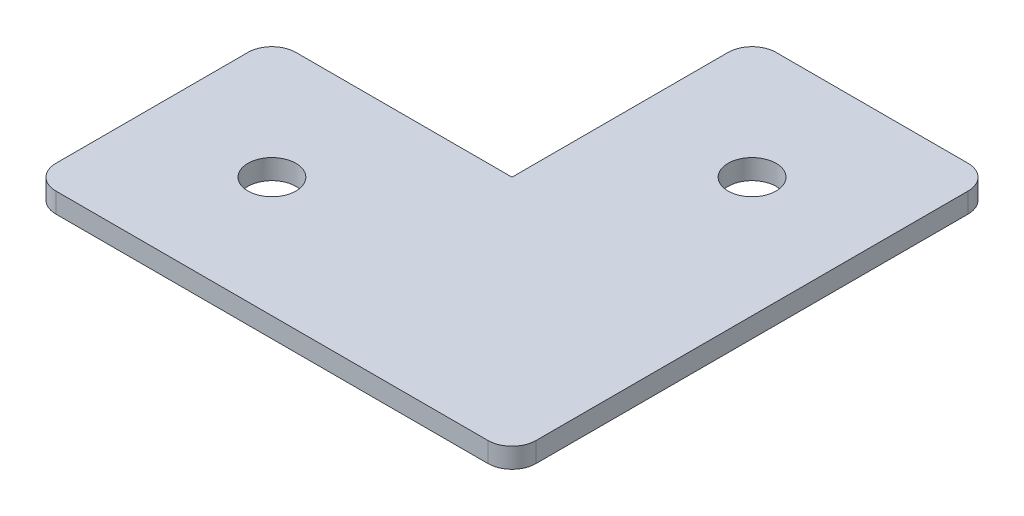
ISO-10303-21;
HEADER;
FILE_DESCRIPTION(('STEP AP214'),'2;1');
FILE_NAME('part.step','',(''),(''),'','','');
FILE_SCHEMA(('AUTOMOTIVE_DESIGN { 1 0 10303 214 1 1 1 1 }'));
ENDSEC;
DATA;
#1=APPLICATION_CONTEXT('core data for automotive mechanical design processes');
#2=APPLICATION_PROTOCOL_DEFINITION('international standard','automotive_design',2000,#1);
#3=PRODUCT_CONTEXT('',#1,'mechanical');
#4=PRODUCT('Part','Part','',(#3));
#5=PRODUCT_RELATED_PRODUCT_CATEGORY('part','',(#4));
#6=PRODUCT_DEFINITION_FORMATION('','',#4);
#7=PRODUCT_DEFINITION_CONTEXT('part definition',#1,'design');
#8=PRODUCT_DEFINITION('design','',#6,#7);
#9=PRODUCT_DEFINITION_SHAPE('','',#8);
#10=(LENGTH_UNIT() NAMED_UNIT(*) SI_UNIT(.MILLI.,.METRE.));
#11=(NAMED_UNIT(*) PLANE_ANGLE_UNIT() SI_UNIT($,.RADIAN.));
#12=(NAMED_UNIT(*) SI_UNIT($,.STERADIAN.) SOLID_ANGLE_UNIT());
#13=UNCERTAINTY_MEASURE_WITH_UNIT(LENGTH_MEASURE(1.E-05),#10,'distance_accuracy_value','');
#14=(GEOMETRIC_REPRESENTATION_CONTEXT(3) GLOBAL_UNCERTAINTY_ASSIGNED_CONTEXT((#13)) GLOBAL_UNIT_ASSIGNED_CONTEXT((#10,
#11,#12)) REPRESENTATION_CONTEXT('',''));
#15=CARTESIAN_POINT('',(0.,0.,0.));
#16=DIRECTION('',(0.,0.,1.));
#17=DIRECTION('',(1.,0.,0.));
#18=AXIS2_PLACEMENT_3D('',#15,#16,#17);
#19=CARTESIAN_POINT('',(-12.4698795180723,2.5,-24.8493975903614));
#20=DIRECTION('',(1.,0.,0.));
#21=DIRECTION('',(0.,0.,-1.));
#22=AXIS2_PLACEMENT_3D('',#19,#20,#21);
#23=PLANE('',#22);
#24=DIRECTION('',(0.,0.,1.));
#25=VECTOR('',#24,1.);
#26=CARTESIAN_POINT('',(-12.4698795180723,2.5,-24.8493975903614));
#27=LINE('',#26,#25);
#28=CARTESIAN_POINT('',(-12.4698795180723,2.5,-21.8493975903615));
#29=VERTEX_POINT('',#28);
#30=CARTESIAN_POINT('',(-12.4698795180723,2.5,5.15060240963856));
#31=VERTEX_POINT('',#30);
#32=EDGE_CURVE('E118',#29,#31,#27,.T.);
#33=ORIENTED_EDGE('',*,*,#32,.F.);
#34=DIRECTION('',(0.,-1.,0.));
#35=VECTOR('',#34,1.);
#36=CARTESIAN_POINT('',(-12.4698795180723,2.5,-21.8493975903615));
#37=LINE('',#36,#35);
#38=CARTESIAN_POINT('',(-12.4698795180723,0.,-21.8493975903615));
#39=VERTEX_POINT('',#38);
#40=EDGE_CURVE('E183',#29,#39,#37,.T.);
#41=ORIENTED_EDGE('',*,*,#40,.T.);
#42=DIRECTION('',(0.,0.,1.));
#43=VECTOR('',#42,1.);
#44=CARTESIAN_POINT('',(-12.4698795180723,0.,-24.8493975903614));
#45=LINE('',#44,#43);
#46=CARTESIAN_POINT('',(-12.4698795180723,0.,5.15060240963856));
#47=VERTEX_POINT('',#46);
#48=EDGE_CURVE('E139',#39,#47,#45,.T.);
#49=ORIENTED_EDGE('',*,*,#48,.T.);
#50=DIRECTION('',(0.,-1.,0.));
#51=VECTOR('',#50,1.);
#52=CARTESIAN_POINT('',(-12.4698795180723,2.5,5.15060240963856));
#53=LINE('',#52,#51);
#54=EDGE_CURVE('E134',#31,#47,#53,.T.);
#55=ORIENTED_EDGE('',*,*,#54,.F.);
#56=EDGE_LOOP('',(#33,#41,#49,#55));
#57=FACE_BOUND('',#56,.T.);
#58=ADVANCED_FACE('F33',(#57),#23,.F.);
#59=CARTESIAN_POINT('',(-12.4698795180723,2.5,5.15060240963856));
#60=DIRECTION('',(0.,0.,1.));
#61=DIRECTION('',(1.,0.,0.));
#62=AXIS2_PLACEMENT_3D('',#59,#60,#61);
#63=PLANE('',#62);
#64=DIRECTION('',(-1.,0.,0.));
#65=VECTOR('',#64,1.);
#66=CARTESIAN_POINT('',(-12.4698795180723,0.,5.15060240963856));
#67=LINE('',#66,#65);
#68=CARTESIAN_POINT('',(-39.4698795180723,0.,5.15060240963856));
#69=VERTEX_POINT('',#68);
#70=EDGE_CURVE('E208',#47,#69,#67,.T.);
#71=ORIENTED_EDGE('',*,*,#70,.T.);
#72=DIRECTION('',(0.,-1.,0.));
#73=VECTOR('',#72,1.);
#74=CARTESIAN_POINT('',(-39.4698795180723,2.5,5.15060240963856));
#75=LINE('',#74,#73);
#76=CARTESIAN_POINT('',(-39.4698795180723,2.5,5.15060240963856));
#77=VERTEX_POINT('',#76);
#78=EDGE_CURVE('E136',#69,#77,#75,.F.);
#79=ORIENTED_EDGE('',*,*,#78,.T.);
#80=DIRECTION('',(-1.,0.,0.));
#81=VECTOR('',#80,1.);
#82=CARTESIAN_POINT('',(-12.4698795180723,2.5,5.15060240963856));
#83=LINE('',#82,#81);
#84=EDGE_CURVE('E121',#31,#77,#83,.T.);
#85=ORIENTED_EDGE('',*,*,#84,.F.);
#86=ORIENTED_EDGE('',*,*,#54,.T.);
#87=EDGE_LOOP('',(#71,#79,#85,#86));
#88=FACE_BOUND('',#87,.T.);
#89=ADVANCED_FACE('F133',(#88),#63,.F.);
#90=CARTESIAN_POINT('',(-42.4698795180723,2.5,35.1506024096386));
#91=DIRECTION('',(1.,0.,0.));
#92=DIRECTION('',(0.,0.,-1.));
#93=AXIS2_PLACEMENT_3D('',#90,#91,#92);
#94=PLANE('',#93);
#95=DIRECTION('',(0.,0.,1.));
#96=VECTOR('',#95,1.);
#97=CARTESIAN_POINT('',(-42.4698795180723,0.,35.1506024096386));
#98=LINE('',#97,#96);
#99=CARTESIAN_POINT('',(-42.4698795180723,0.,8.15060240963856));
#100=VERTEX_POINT('',#99);
#101=CARTESIAN_POINT('',(-42.4698795180723,0.,32.1506024096385));
#102=VERTEX_POINT('',#101);
#103=EDGE_CURVE('E210',#100,#102,#98,.T.);
#104=ORIENTED_EDGE('',*,*,#103,.T.);
#105=DIRECTION('',(0.,-1.,0.));
#106=VECTOR('',#105,1.);
#107=CARTESIAN_POINT('',(-42.4698795180723,2.5,32.1506024096385));
#108=LINE('',#107,#106);
#109=CARTESIAN_POINT('',(-42.4698795180723,2.5,32.1506024096385));
#110=VERTEX_POINT('',#109);
#111=EDGE_CURVE('E161',#102,#110,#108,.F.);
#112=ORIENTED_EDGE('',*,*,#111,.T.);
#113=DIRECTION('',(0.,0.,1.));
#114=VECTOR('',#113,1.);
#115=CARTESIAN_POINT('',(-42.4698795180723,2.5,35.1506024096386));
#116=LINE('',#115,#114);
#117=CARTESIAN_POINT('',(-42.4698795180723,2.5,8.15060240963856));
#118=VERTEX_POINT('',#117);
#119=EDGE_CURVE('E137',#118,#110,#116,.T.);
#120=ORIENTED_EDGE('',*,*,#119,.F.);
#121=DIRECTION('',(0.,-1.,0.));
#122=VECTOR('',#121,1.);
#123=CARTESIAN_POINT('',(-42.4698795180723,2.5,8.15060240963856));
#124=LINE('',#123,#122);
#125=EDGE_CURVE('E141',#118,#100,#124,.T.);
#126=ORIENTED_EDGE('',*,*,#125,.T.);
#127=EDGE_LOOP('',(#104,#112,#120,#126));
#128=FACE_BOUND('',#127,.T.);
#129=ADVANCED_FACE('F231',(#128),#94,.F.);
#130=CARTESIAN_POINT('',(-12.4698795180723,2.5,35.1506024096386));
#131=DIRECTION('',(0.,0.,-1.));
#132=DIRECTION('',(-1.,0.,0.));
#133=AXIS2_PLACEMENT_3D('',#130,#131,#132);
#134=PLANE('',#133);
#135=DIRECTION('',(1.,0.,0.));
#136=VECTOR('',#135,1.);
#137=CARTESIAN_POINT('',(-12.4698795180723,0.,35.1506024096386));
#138=LINE('',#137,#136);
#139=CARTESIAN_POINT('',(-39.4698795180723,0.,35.1506024096386));
#140=VERTEX_POINT('',#139);
#141=CARTESIAN_POINT('',(14.5301204819277,0.,35.1506024096386));
#142=VERTEX_POINT('',#141);
#143=EDGE_CURVE('E213',#140,#142,#138,.T.);
#144=ORIENTED_EDGE('',*,*,#143,.T.);
#145=DIRECTION('',(0.,-1.,0.));
#146=VECTOR('',#145,1.);
#147=CARTESIAN_POINT('',(14.5301204819277,2.5,35.1506024096386));
#148=LINE('',#147,#146);
#149=CARTESIAN_POINT('',(14.5301204819277,2.5,35.1506024096385));
#150=VERTEX_POINT('',#149);
#151=EDGE_CURVE('E170',#142,#150,#148,.F.);
#152=ORIENTED_EDGE('',*,*,#151,.T.);
#153=DIRECTION('',(1.,0.,0.));
#154=VECTOR('',#153,1.);
#155=CARTESIAN_POINT('',(-12.4698795180723,2.5,35.1506024096386));
#156=LINE('',#155,#154);
#157=CARTESIAN_POINT('',(-39.4698795180723,2.5,35.1506024096386));
#158=VERTEX_POINT('',#157);
#159=EDGE_CURVE('E202',#158,#150,#156,.T.);
#160=ORIENTED_EDGE('',*,*,#159,.F.);
#161=DIRECTION('',(0.,-1.,0.));
#162=VECTOR('',#161,1.);
#163=CARTESIAN_POINT('',(-39.4698795180723,2.5,35.1506024096386));
#164=LINE('',#163,#162);
#165=EDGE_CURVE('E156',#158,#140,#164,.T.);
#166=ORIENTED_EDGE('',*,*,#165,.T.);
#167=EDGE_LOOP('',(#144,#152,#160,#166));
#168=FACE_BOUND('',#167,.T.);
#169=ADVANCED_FACE('F239',(#168),#134,.F.);
#170=CARTESIAN_POINT('',(17.5301204819277,2.5,-24.8493975903614));
#171=DIRECTION('',(-1.,0.,0.));
#172=DIRECTION('',(0.,0.,1.));
#173=AXIS2_PLACEMENT_3D('',#170,#171,#172);
#174=PLANE('',#173);
#175=DIRECTION('',(0.,0.,-1.));
#176=VECTOR('',#175,1.);
#177=CARTESIAN_POINT('',(17.5301204819277,0.,-24.8493975903614));
#178=LINE('',#177,#176);
#179=CARTESIAN_POINT('',(17.5301204819277,0.,32.1506024096385));
#180=VERTEX_POINT('',#179);
#181=CARTESIAN_POINT('',(17.5301204819277,0.,-21.8493975903615));
#182=VERTEX_POINT('',#181);
#183=EDGE_CURVE('E215',#180,#182,#178,.T.);
#184=ORIENTED_EDGE('',*,*,#183,.T.);
#185=DIRECTION('',(0.,-1.,0.));
#186=VECTOR('',#185,1.);
#187=CARTESIAN_POINT('',(17.5301204819277,2.5,-21.8493975903615));
#188=LINE('',#187,#186);
#189=CARTESIAN_POINT('',(17.5301204819277,2.5,-21.8493975903615));
#190=VERTEX_POINT('',#189);
#191=EDGE_CURVE('E179',#182,#190,#188,.F.);
#192=ORIENTED_EDGE('',*,*,#191,.T.);
#193=DIRECTION('',(0.,0.,-1.));
#194=VECTOR('',#193,1.);
#195=CARTESIAN_POINT('',(17.5301204819277,2.5,-24.8493975903614));
#196=LINE('',#195,#194);
#197=CARTESIAN_POINT('',(17.5301204819277,2.5,32.1506024096385));
#198=VERTEX_POINT('',#197);
#199=EDGE_CURVE('E147',#198,#190,#196,.T.);
#200=ORIENTED_EDGE('',*,*,#199,.F.);
#201=DIRECTION('',(0.,-1.,0.));
#202=VECTOR('',#201,1.);
#203=CARTESIAN_POINT('',(17.5301204819277,2.5,32.1506024096385));
#204=LINE('',#203,#202);
#205=EDGE_CURVE('E165',#198,#180,#204,.T.);
#206=ORIENTED_EDGE('',*,*,#205,.T.);
#207=EDGE_LOOP('',(#184,#192,#200,#206));
#208=FACE_BOUND('',#207,.T.);
#209=ADVANCED_FACE('F247',(#208),#174,.F.);
#210=CARTESIAN_POINT('',(-12.4698795180723,2.5,-24.8493975903614));
#211=DIRECTION('',(0.,0.,1.));
#212=DIRECTION('',(1.,0.,0.));
#213=AXIS2_PLACEMENT_3D('',#210,#211,#212);
#214=PLANE('',#213);
#215=DIRECTION('',(-1.,0.,0.));
#216=VECTOR('',#215,1.);
#217=CARTESIAN_POINT('',(-12.4698795180723,0.,-24.8493975903614));
#218=LINE('',#217,#216);
#219=CARTESIAN_POINT('',(14.5301204819277,0.,-24.8493975903614));
#220=VERTEX_POINT('',#219);
#221=CARTESIAN_POINT('',(-9.4698795180723,0.,-24.8493975903614));
#222=VERTEX_POINT('',#221);
#223=EDGE_CURVE('E128',#220,#222,#218,.T.);
#224=ORIENTED_EDGE('',*,*,#223,.T.);
#225=DIRECTION('',(0.,-1.,0.));
#226=VECTOR('',#225,1.);
#227=CARTESIAN_POINT('',(-9.4698795180723,2.5,-24.8493975903614));
#228=LINE('',#227,#226);
#229=CARTESIAN_POINT('',(-9.4698795180723,2.5,-24.8493975903614));
#230=VERTEX_POINT('',#229);
#231=EDGE_CURVE('E42',#222,#230,#228,.F.);
#232=ORIENTED_EDGE('',*,*,#231,.T.);
#233=DIRECTION('',(-1.,0.,0.));
#234=VECTOR('',#233,1.);
#235=CARTESIAN_POINT('',(-12.4698795180723,2.5,-24.8493975903614));
#236=LINE('',#235,#234);
#237=CARTESIAN_POINT('',(14.5301204819277,2.5,-24.8493975903614));
#238=VERTEX_POINT('',#237);
#239=EDGE_CURVE('E142',#238,#230,#236,.T.);
#240=ORIENTED_EDGE('',*,*,#239,.F.);
#241=DIRECTION('',(0.,-1.,0.));
#242=VECTOR('',#241,1.);
#243=CARTESIAN_POINT('',(14.5301204819277,2.5,-24.8493975903614));
#244=LINE('',#243,#242);
#245=EDGE_CURVE('E174',#238,#220,#244,.T.);
#246=ORIENTED_EDGE('',*,*,#245,.T.);
#247=EDGE_LOOP('',(#224,#232,#240,#246));
#248=FACE_BOUND('',#247,.T.);
#249=ADVANCED_FACE('F220',(#248),#214,.F.);
#250=CARTESIAN_POINT('',(0.,2.5,0.));
#251=DIRECTION('',(0.,-1.,0.));
#252=DIRECTION('',(0.,0.,-1.));
#253=AXIS2_PLACEMENT_3D('',#250,#251,#252);
#254=PLANE('',#253);
#255=CARTESIAN_POINT('',(2.5301204819277,2.5,-9.84939759036145));
#256=DIRECTION('',(0.,1.,0.));
#257=DIRECTION('',(0.,0.,1.));
#258=AXIS2_PLACEMENT_3D('',#255,#256,#257);
#259=CIRCLE('',#258,3.);
#260=CARTESIAN_POINT('',(2.5301204819277,2.5,-6.84939759036145));
#261=VERTEX_POINT('',#260);
#262=EDGE_CURVE('E188',#261,#261,#259,.T.);
#263=ORIENTED_EDGE('',*,*,#262,.F.);
#264=EDGE_LOOP('',(#263));
#265=FACE_BOUND('',#264,.T.);
#266=CARTESIAN_POINT('',(-27.4698795180723,2.5,20.1506024096386));
#267=DIRECTION('',(0.,1.,0.));
#268=DIRECTION('',(0.,0.,1.));
#269=AXIS2_PLACEMENT_3D('',#266,#267,#268);
#270=CIRCLE('',#269,3.);
#271=CARTESIAN_POINT('',(-27.4698795180723,2.5,23.1506024096386));
#272=VERTEX_POINT('',#271);
#273=EDGE_CURVE('E193',#272,#272,#270,.T.);
#274=ORIENTED_EDGE('',*,*,#273,.F.);
#275=EDGE_LOOP('',(#274));
#276=FACE_BOUND('',#275,.T.);
#277=ORIENTED_EDGE('',*,*,#239,.T.);
#278=CARTESIAN_POINT('',(-9.4698795180723,2.5,-21.8493975903615));
#279=DIRECTION('',(0.,-1.,0.));
#280=DIRECTION('',(0.,0.,-1.));
#281=AXIS2_PLACEMENT_3D('',#278,#279,#280);
#282=CIRCLE('',#281,3.);
#283=EDGE_CURVE('E11',#230,#29,#282,.F.);
#284=ORIENTED_EDGE('',*,*,#283,.T.);
#285=ORIENTED_EDGE('',*,*,#32,.T.);
#286=ORIENTED_EDGE('',*,*,#84,.T.);
#287=CARTESIAN_POINT('',(-39.4698795180723,2.5,8.15060240963856));
#288=DIRECTION('',(0.,-1.,0.));
#289=DIRECTION('',(0.,0.,-1.));
#290=AXIS2_PLACEMENT_3D('',#287,#288,#289);
#291=CIRCLE('',#290,3.);
#292=EDGE_CURVE('E154',#77,#118,#291,.F.);
#293=ORIENTED_EDGE('',*,*,#292,.T.);
#294=ORIENTED_EDGE('',*,*,#119,.T.);
#295=CARTESIAN_POINT('',(-39.4698795180723,2.5,32.1506024096385));
#296=DIRECTION('',(0.,-1.,0.));
#297=DIRECTION('',(0.,0.,-1.));
#298=AXIS2_PLACEMENT_3D('',#295,#296,#297);
#299=CIRCLE('',#298,3.);
#300=EDGE_CURVE('E163',#110,#158,#299,.F.);
#301=ORIENTED_EDGE('',*,*,#300,.T.);
#302=ORIENTED_EDGE('',*,*,#159,.T.);
#303=CARTESIAN_POINT('',(14.5301204819277,2.5,32.1506024096385));
#304=DIRECTION('',(0.,-1.,0.));
#305=DIRECTION('',(0.,0.,-1.));
#306=AXIS2_PLACEMENT_3D('',#303,#304,#305);
#307=CIRCLE('',#306,3.);
#308=EDGE_CURVE('E172',#150,#198,#307,.F.);
#309=ORIENTED_EDGE('',*,*,#308,.T.);
#310=ORIENTED_EDGE('',*,*,#199,.T.);
#311=CARTESIAN_POINT('',(14.5301204819277,2.5,-21.8493975903615));
#312=DIRECTION('',(0.,-1.,0.));
#313=DIRECTION('',(0.,0.,-1.));
#314=AXIS2_PLACEMENT_3D('',#311,#312,#313);
#315=CIRCLE('',#314,3.);
#316=EDGE_CURVE('E181',#190,#238,#315,.F.);
#317=ORIENTED_EDGE('',*,*,#316,.T.);
#318=EDGE_LOOP('',(#277,#284,#285,#286,#293,#294,#301,#302,#309,#310,#317));
#319=FACE_BOUND('',#318,.T.);
#320=ADVANCED_FACE('F120',(#265,#276,#319),#254,.F.);
#321=CARTESIAN_POINT('',(0.,0.,0.));
#322=DIRECTION('',(0.,-1.,0.));
#323=DIRECTION('',(0.,0.,-1.));
#324=AXIS2_PLACEMENT_3D('',#321,#322,#323);
#325=PLANE('',#324);
#326=CARTESIAN_POINT('',(2.5301204819277,0.,-9.84939759036145));
#327=DIRECTION('',(0.,-1.,0.));
#328=DIRECTION('',(0.,0.,-1.));
#329=AXIS2_PLACEMENT_3D('',#326,#327,#328);
#330=CIRCLE('',#329,3.);
#331=CARTESIAN_POINT('',(2.5301204819277,0.,-12.8493975903615));
#332=VERTEX_POINT('',#331);
#333=EDGE_CURVE('E37',#332,#332,#330,.T.);
#334=ORIENTED_EDGE('',*,*,#333,.F.);
#335=EDGE_LOOP('',(#334));
#336=FACE_BOUND('',#335,.T.);
#337=CARTESIAN_POINT('',(-27.4698795180723,0.,20.1506024096386));
#338=DIRECTION('',(0.,-1.,0.));
#339=DIRECTION('',(0.,0.,-1.));
#340=AXIS2_PLACEMENT_3D('',#337,#338,#339);
#341=CIRCLE('',#340,3.);
#342=CARTESIAN_POINT('',(-27.4698795180723,0.,17.1506024096386));
#343=VERTEX_POINT('',#342);
#344=EDGE_CURVE('E186',#343,#343,#341,.T.);
#345=ORIENTED_EDGE('',*,*,#344,.F.);
#346=EDGE_LOOP('',(#345));
#347=FACE_BOUND('',#346,.T.);
#348=ORIENTED_EDGE('',*,*,#48,.F.);
#349=CARTESIAN_POINT('',(-9.4698795180723,0.,-21.8493975903615));
#350=DIRECTION('',(0.,-1.,0.));
#351=DIRECTION('',(0.,0.,-1.));
#352=AXIS2_PLACEMENT_3D('',#349,#350,#351);
#353=CIRCLE('',#352,3.);
#354=EDGE_CURVE('E57',#39,#222,#353,.T.);
#355=ORIENTED_EDGE('',*,*,#354,.T.);
#356=ORIENTED_EDGE('',*,*,#223,.F.);
#357=CARTESIAN_POINT('',(14.5301204819277,0.,-21.8493975903615));
#358=DIRECTION('',(0.,-1.,0.));
#359=DIRECTION('',(0.,0.,-1.));
#360=AXIS2_PLACEMENT_3D('',#357,#358,#359);
#361=CIRCLE('',#360,3.);
#362=EDGE_CURVE('E177',#220,#182,#361,.T.);
#363=ORIENTED_EDGE('',*,*,#362,.T.);
#364=ORIENTED_EDGE('',*,*,#183,.F.);
#365=CARTESIAN_POINT('',(14.5301204819277,0.,32.1506024096385));
#366=DIRECTION('',(0.,-1.,0.));
#367=DIRECTION('',(0.,0.,-1.));
#368=AXIS2_PLACEMENT_3D('',#365,#366,#367);
#369=CIRCLE('',#368,3.);
#370=EDGE_CURVE('E168',#180,#142,#369,.T.);
#371=ORIENTED_EDGE('',*,*,#370,.T.);
#372=ORIENTED_EDGE('',*,*,#143,.F.);
#373=CARTESIAN_POINT('',(-39.4698795180723,0.,32.1506024096385));
#374=DIRECTION('',(0.,-1.,0.));
#375=DIRECTION('',(0.,0.,-1.));
#376=AXIS2_PLACEMENT_3D('',#373,#374,#375);
#377=CIRCLE('',#376,3.);
#378=EDGE_CURVE('E159',#140,#102,#377,.T.);
#379=ORIENTED_EDGE('',*,*,#378,.T.);
#380=ORIENTED_EDGE('',*,*,#103,.F.);
#381=CARTESIAN_POINT('',(-39.4698795180723,0.,8.15060240963856));
#382=DIRECTION('',(0.,-1.,0.));
#383=DIRECTION('',(0.,0.,-1.));
#384=AXIS2_PLACEMENT_3D('',#381,#382,#383);
#385=CIRCLE('',#384,3.);
#386=EDGE_CURVE('E145',#100,#69,#385,.T.);
#387=ORIENTED_EDGE('',*,*,#386,.T.);
#388=ORIENTED_EDGE('',*,*,#70,.F.);
#389=EDGE_LOOP('',(#348,#355,#356,#363,#364,#371,#372,#379,#380,#387,#388));
#390=FACE_BOUND('',#389,.T.);
#391=ADVANCED_FACE('F223',(#336,#347,#390),#325,.T.);
#392=CARTESIAN_POINT('',(-39.4698795180723,2.5,8.15060240963856));
#393=DIRECTION('',(0.,-1.,0.));
#394=DIRECTION('',(0.,0.,-1.));
#395=AXIS2_PLACEMENT_3D('',#392,#393,#394);
#396=CYLINDRICAL_SURFACE('',#395,3.);
#397=ORIENTED_EDGE('',*,*,#292,.F.);
#398=ORIENTED_EDGE('',*,*,#78,.F.);
#399=ORIENTED_EDGE('',*,*,#386,.F.);
#400=ORIENTED_EDGE('',*,*,#125,.F.);
#401=EDGE_LOOP('',(#397,#398,#399,#400));
#402=FACE_BOUND('',#401,.T.);
#403=ADVANCED_FACE('F226',(#402),#396,.T.);
#404=CARTESIAN_POINT('',(-39.4698795180723,2.5,32.1506024096385));
#405=DIRECTION('',(0.,-1.,0.));
#406=DIRECTION('',(0.,0.,-1.));
#407=AXIS2_PLACEMENT_3D('',#404,#405,#406);
#408=CYLINDRICAL_SURFACE('',#407,3.);
#409=ORIENTED_EDGE('',*,*,#300,.F.);
#410=ORIENTED_EDGE('',*,*,#111,.F.);
#411=ORIENTED_EDGE('',*,*,#378,.F.);
#412=ORIENTED_EDGE('',*,*,#165,.F.);
#413=EDGE_LOOP('',(#409,#410,#411,#412));
#414=FACE_BOUND('',#413,.T.);
#415=ADVANCED_FACE('F234',(#414),#408,.T.);
#416=CARTESIAN_POINT('',(14.5301204819277,2.5,32.1506024096385));
#417=DIRECTION('',(0.,-1.,0.));
#418=DIRECTION('',(0.,0.,-1.));
#419=AXIS2_PLACEMENT_3D('',#416,#417,#418);
#420=CYLINDRICAL_SURFACE('',#419,3.);
#421=ORIENTED_EDGE('',*,*,#308,.F.);
#422=ORIENTED_EDGE('',*,*,#151,.F.);
#423=ORIENTED_EDGE('',*,*,#370,.F.);
#424=ORIENTED_EDGE('',*,*,#205,.F.);
#425=EDGE_LOOP('',(#421,#422,#423,#424));
#426=FACE_BOUND('',#425,.T.);
#427=ADVANCED_FACE('F243',(#426),#420,.T.);
#428=CARTESIAN_POINT('',(14.5301204819277,2.5,-21.8493975903615));
#429=DIRECTION('',(0.,-1.,0.));
#430=DIRECTION('',(0.,0.,-1.));
#431=AXIS2_PLACEMENT_3D('',#428,#429,#430);
#432=CYLINDRICAL_SURFACE('',#431,3.);
#433=ORIENTED_EDGE('',*,*,#316,.F.);
#434=ORIENTED_EDGE('',*,*,#191,.F.);
#435=ORIENTED_EDGE('',*,*,#362,.F.);
#436=ORIENTED_EDGE('',*,*,#245,.F.);
#437=EDGE_LOOP('',(#433,#434,#435,#436));
#438=FACE_BOUND('',#437,.T.);
#439=ADVANCED_FACE('F249',(#438),#432,.T.);
#440=CARTESIAN_POINT('',(-9.4698795180723,2.5,-21.8493975903615));
#441=DIRECTION('',(0.,-1.,0.));
#442=DIRECTION('',(0.,0.,-1.));
#443=AXIS2_PLACEMENT_3D('',#440,#441,#442);
#444=CYLINDRICAL_SURFACE('',#443,3.);
#445=ORIENTED_EDGE('',*,*,#283,.F.);
#446=ORIENTED_EDGE('',*,*,#231,.F.);
#447=ORIENTED_EDGE('',*,*,#354,.F.);
#448=ORIENTED_EDGE('',*,*,#40,.F.);
#449=EDGE_LOOP('',(#445,#446,#447,#448));
#450=FACE_BOUND('',#449,.T.);
#451=ADVANCED_FACE('F35',(#450),#444,.T.);
#452=CARTESIAN_POINT('',(-27.4698795180723,-0.5,20.1506024096386));
#453=DIRECTION('',(0.,1.,0.));
#454=DIRECTION('',(0.,0.,1.));
#455=AXIS2_PLACEMENT_3D('',#452,#453,#454);
#456=CYLINDRICAL_SURFACE('',#455,3.);
#457=ORIENTED_EDGE('',*,*,#344,.T.);
#458=EDGE_LOOP('',(#457));
#459=FACE_BOUND('',#458,.T.);
#460=ORIENTED_EDGE('',*,*,#273,.T.);
#461=EDGE_LOOP('',(#460));
#462=FACE_BOUND('',#461,.T.);
#463=ADVANCED_FACE('F255',(#459,#462),#456,.F.);
#464=CARTESIAN_POINT('',(2.5301204819277,-0.5,-9.84939759036145));
#465=DIRECTION('',(0.,1.,0.));
#466=DIRECTION('',(0.,0.,1.));
#467=AXIS2_PLACEMENT_3D('',#464,#465,#466);
#468=CYLINDRICAL_SURFACE('',#467,3.);
#469=ORIENTED_EDGE('',*,*,#333,.T.);
#470=EDGE_LOOP('',(#469));
#471=FACE_BOUND('',#470,.T.);
#472=ORIENTED_EDGE('',*,*,#262,.T.);
#473=EDGE_LOOP('',(#472));
#474=FACE_BOUND('',#473,.T.);
#475=ADVANCED_FACE('F340',(#471,#474),#468,.F.);
#476=CLOSED_SHELL('',(#58,#89,#129,#169,#209,#249,#320,#391,#403,#415,#427,#439,#451,#463,#475));
#477=MANIFOLD_SOLID_BREP('B2',#476);
#478=ADVANCED_BREP_SHAPE_REPRESENTATION('',(#18,#477),#14);
#479=SHAPE_DEFINITION_REPRESENTATION(#9,#478);
ENDSEC;
END-ISO-10303-21;
